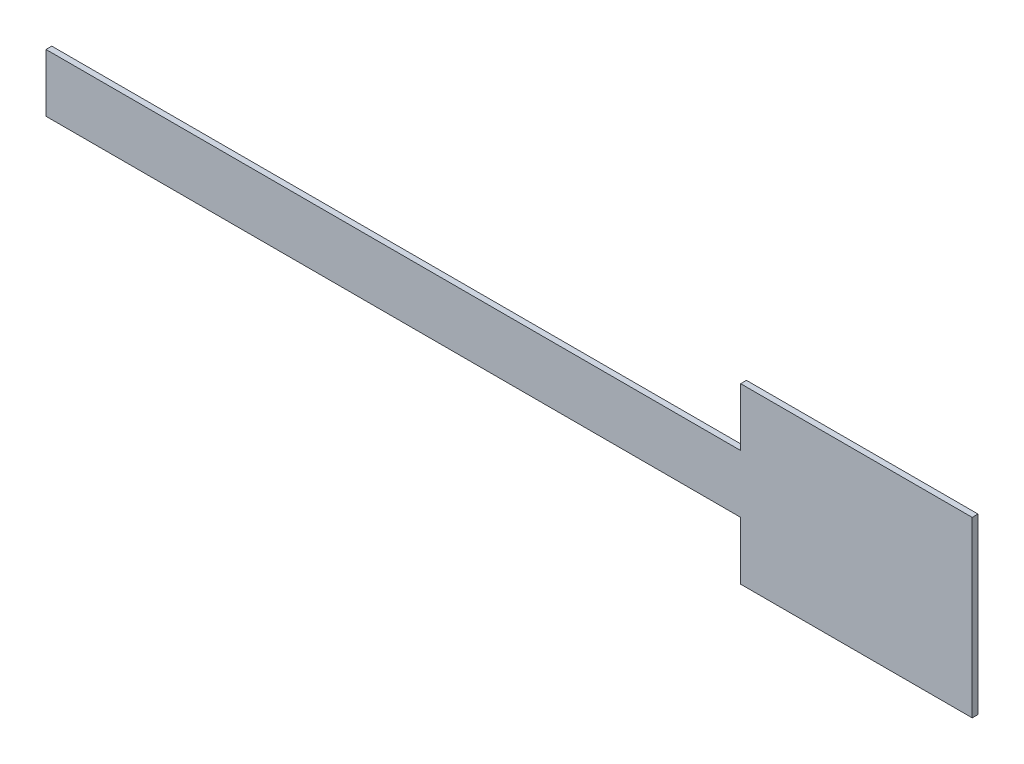
ISO-10303-21;
HEADER;
FILE_DESCRIPTION(('STEP AP214'),'2;1');
FILE_NAME('part.step','',(''),(''),'','','');
FILE_SCHEMA(('AUTOMOTIVE_DESIGN { 1 0 10303 214 1 1 1 1 }'));
ENDSEC;
DATA;
#1=APPLICATION_CONTEXT('core data for automotive mechanical design processes');
#2=APPLICATION_PROTOCOL_DEFINITION('international standard','automotive_design',2000,#1);
#3=PRODUCT_CONTEXT('',#1,'mechanical');
#4=PRODUCT('Part','Part','',(#3));
#5=PRODUCT_RELATED_PRODUCT_CATEGORY('part','',(#4));
#6=PRODUCT_DEFINITION_FORMATION('','',#4);
#7=PRODUCT_DEFINITION_CONTEXT('part definition',#1,'design');
#8=PRODUCT_DEFINITION('design','',#6,#7);
#9=PRODUCT_DEFINITION_SHAPE('','',#8);
#10=(LENGTH_UNIT() NAMED_UNIT(*) SI_UNIT(.MILLI.,.METRE.));
#11=(NAMED_UNIT(*) PLANE_ANGLE_UNIT() SI_UNIT($,.RADIAN.));
#12=(NAMED_UNIT(*) SI_UNIT($,.STERADIAN.) SOLID_ANGLE_UNIT());
#13=UNCERTAINTY_MEASURE_WITH_UNIT(LENGTH_MEASURE(1.E-05),#10,'distance_accuracy_value','');
#14=(GEOMETRIC_REPRESENTATION_CONTEXT(3) GLOBAL_UNCERTAINTY_ASSIGNED_CONTEXT((#13)) GLOBAL_UNIT_ASSIGNED_CONTEXT((#10,
#11,#12)) REPRESENTATION_CONTEXT('',''));
#15=CARTESIAN_POINT('',(0.,0.,0.));
#16=DIRECTION('',(0.,0.,1.));
#17=DIRECTION('',(1.,0.,0.));
#18=AXIS2_PLACEMENT_3D('',#15,#16,#17);
#19=CARTESIAN_POINT('',(-237.983861782121,0.686513851456686,2.54));
#20=DIRECTION('',(0.,1.,0.));
#21=DIRECTION('',(0.,0.,1.));
#22=AXIS2_PLACEMENT_3D('',#19,#20,#21);
#23=PLANE('',#22);
#24=DIRECTION('',(1.,0.,0.));
#25=VECTOR('',#24,1.);
#26=CARTESIAN_POINT('',(-237.983861782121,0.686513851456686,0.));
#27=LINE('',#26,#25);
#28=CARTESIAN_POINT('',(-237.983861782121,0.686513851456686,0.));
#29=VERTEX_POINT('',#28);
#30=CARTESIAN_POINT('',(66.8161382178786,0.686513851456686,0.));
#31=VERTEX_POINT('',#30);
#32=EDGE_CURVE('E129',#29,#31,#27,.T.);
#33=ORIENTED_EDGE('',*,*,#32,.T.);
#34=DIRECTION('',(0.,0.,-1.));
#35=VECTOR('',#34,1.);
#36=CARTESIAN_POINT('',(66.8161382178786,0.686513851456686,2.54));
#37=LINE('',#36,#35);
#38=CARTESIAN_POINT('',(66.8161382178786,0.686513851456686,2.54));
#39=VERTEX_POINT('',#38);
#40=EDGE_CURVE('E11',#39,#31,#37,.T.);
#41=ORIENTED_EDGE('',*,*,#40,.F.);
#42=DIRECTION('',(1.,0.,0.));
#43=VECTOR('',#42,1.);
#44=CARTESIAN_POINT('',(-237.983861782121,0.686513851456686,2.54));
#45=LINE('',#44,#43);
#46=CARTESIAN_POINT('',(-237.983861782121,0.686513851456686,2.54));
#47=VERTEX_POINT('',#46);
#48=EDGE_CURVE('E143',#47,#39,#45,.T.);
#49=ORIENTED_EDGE('',*,*,#48,.F.);
#50=DIRECTION('',(0.,0.,-1.));
#51=VECTOR('',#50,1.);
#52=CARTESIAN_POINT('',(-237.983861782121,0.686513851456686,2.54));
#53=LINE('',#52,#51);
#54=EDGE_CURVE('E125',#47,#29,#53,.T.);
#55=ORIENTED_EDGE('',*,*,#54,.T.);
#56=EDGE_LOOP('',(#33,#41,#49,#55));
#57=FACE_BOUND('',#56,.T.);
#58=ADVANCED_FACE('F33',(#57),#23,.F.);
#59=CARTESIAN_POINT('',(66.8161382178786,0.686513851456686,2.54));
#60=DIRECTION('',(1.,0.,0.));
#61=DIRECTION('',(0.,1.,0.));
#62=AXIS2_PLACEMENT_3D('',#59,#60,#61);
#63=PLANE('',#62);
#64=DIRECTION('',(0.,-1.,0.));
#65=VECTOR('',#64,1.);
#66=CARTESIAN_POINT('',(66.8161382178786,0.686513851456686,0.));
#67=LINE('',#66,#65);
#68=CARTESIAN_POINT('',(66.8161382178786,-24.7134861485433,0.));
#69=VERTEX_POINT('',#68);
#70=EDGE_CURVE('E132',#31,#69,#67,.T.);
#71=ORIENTED_EDGE('',*,*,#70,.T.);
#72=DIRECTION('',(0.,0.,-1.));
#73=VECTOR('',#72,1.);
#74=CARTESIAN_POINT('',(66.8161382178786,-24.7134861485433,2.54));
#75=LINE('',#74,#73);
#76=CARTESIAN_POINT('',(66.8161382178786,-24.7134861485433,2.54));
#77=VERTEX_POINT('',#76);
#78=EDGE_CURVE('E41',#77,#69,#75,.T.);
#79=ORIENTED_EDGE('',*,*,#78,.F.);
#80=DIRECTION('',(0.,-1.,0.));
#81=VECTOR('',#80,1.);
#82=CARTESIAN_POINT('',(66.8161382178786,0.686513851456686,2.54));
#83=LINE('',#82,#81);
#84=EDGE_CURVE('E92',#39,#77,#83,.T.);
#85=ORIENTED_EDGE('',*,*,#84,.F.);
#86=ORIENTED_EDGE('',*,*,#40,.T.);
#87=EDGE_LOOP('',(#71,#79,#85,#86));
#88=FACE_BOUND('',#87,.T.);
#89=ADVANCED_FACE('F178',(#88),#63,.F.);
#90=CARTESIAN_POINT('',(66.8161382178786,-24.7134861485433,2.54));
#91=DIRECTION('',(0.,1.,0.));
#92=DIRECTION('',(0.,0.,1.));
#93=AXIS2_PLACEMENT_3D('',#90,#91,#92);
#94=PLANE('',#93);
#95=DIRECTION('',(1.,0.,0.));
#96=VECTOR('',#95,1.);
#97=CARTESIAN_POINT('',(66.8161382178786,-24.7134861485433,0.));
#98=LINE('',#97,#96);
#99=CARTESIAN_POINT('',(168.416138217879,-24.7134861485433,0.));
#100=VERTEX_POINT('',#99);
#101=EDGE_CURVE('E134',#69,#100,#98,.T.);
#102=ORIENTED_EDGE('',*,*,#101,.T.);
#103=DIRECTION('',(0.,0.,-1.));
#104=VECTOR('',#103,1.);
#105=CARTESIAN_POINT('',(168.416138217879,-24.7134861485433,2.54));
#106=LINE('',#105,#104);
#107=CARTESIAN_POINT('',(168.416138217879,-24.7134861485433,2.54));
#108=VERTEX_POINT('',#107);
#109=EDGE_CURVE('E150',#108,#100,#106,.T.);
#110=ORIENTED_EDGE('',*,*,#109,.F.);
#111=DIRECTION('',(1.,0.,0.));
#112=VECTOR('',#111,1.);
#113=CARTESIAN_POINT('',(66.8161382178786,-24.7134861485433,2.54));
#114=LINE('',#113,#112);
#115=EDGE_CURVE('E158',#77,#108,#114,.T.);
#116=ORIENTED_EDGE('',*,*,#115,.F.);
#117=ORIENTED_EDGE('',*,*,#78,.T.);
#118=EDGE_LOOP('',(#102,#110,#116,#117));
#119=FACE_BOUND('',#118,.T.);
#120=ADVANCED_FACE('F156',(#119),#94,.F.);
#121=CARTESIAN_POINT('',(168.416138217879,51.4865138514567,2.54));
#122=DIRECTION('',(-1.,0.,0.));
#123=DIRECTION('',(0.,-1.,0.));
#124=AXIS2_PLACEMENT_3D('',#121,#122,#123);
#125=PLANE('',#124);
#126=DIRECTION('',(0.,1.,0.));
#127=VECTOR('',#126,1.);
#128=CARTESIAN_POINT('',(168.416138217879,51.4865138514567,0.));
#129=LINE('',#128,#127);
#130=CARTESIAN_POINT('',(168.416138217879,51.4865138514567,0.));
#131=VERTEX_POINT('',#130);
#132=EDGE_CURVE('E136',#100,#131,#129,.T.);
#133=ORIENTED_EDGE('',*,*,#132,.T.);
#134=DIRECTION('',(0.,0.,-1.));
#135=VECTOR('',#134,1.);
#136=CARTESIAN_POINT('',(168.416138217879,51.4865138514567,2.54));
#137=LINE('',#136,#135);
#138=CARTESIAN_POINT('',(168.416138217879,51.4865138514567,2.54));
#139=VERTEX_POINT('',#138);
#140=EDGE_CURVE('E147',#139,#131,#137,.T.);
#141=ORIENTED_EDGE('',*,*,#140,.F.);
#142=DIRECTION('',(0.,1.,0.));
#143=VECTOR('',#142,1.);
#144=CARTESIAN_POINT('',(168.416138217879,51.4865138514567,2.54));
#145=LINE('',#144,#143);
#146=EDGE_CURVE('E170',#108,#139,#145,.T.);
#147=ORIENTED_EDGE('',*,*,#146,.F.);
#148=ORIENTED_EDGE('',*,*,#109,.T.);
#149=EDGE_LOOP('',(#133,#141,#147,#148));
#150=FACE_BOUND('',#149,.T.);
#151=ADVANCED_FACE('F166',(#150),#125,.F.);
#152=CARTESIAN_POINT('',(66.8161382178786,51.4865138514567,2.54));
#153=DIRECTION('',(0.,-1.,0.));
#154=DIRECTION('',(0.,0.,-1.));
#155=AXIS2_PLACEMENT_3D('',#152,#153,#154);
#156=PLANE('',#155);
#157=DIRECTION('',(-1.,0.,0.));
#158=VECTOR('',#157,1.);
#159=CARTESIAN_POINT('',(66.8161382178786,51.4865138514567,0.));
#160=LINE('',#159,#158);
#161=CARTESIAN_POINT('',(66.8161382178786,51.4865138514567,0.));
#162=VERTEX_POINT('',#161);
#163=EDGE_CURVE('E138',#131,#162,#160,.T.);
#164=ORIENTED_EDGE('',*,*,#163,.T.);
#165=DIRECTION('',(0.,0.,-1.));
#166=VECTOR('',#165,1.);
#167=CARTESIAN_POINT('',(66.8161382178786,51.4865138514567,2.54));
#168=LINE('',#167,#166);
#169=CARTESIAN_POINT('',(66.8161382178786,51.4865138514567,2.54));
#170=VERTEX_POINT('',#169);
#171=EDGE_CURVE('E120',#170,#162,#168,.T.);
#172=ORIENTED_EDGE('',*,*,#171,.F.);
#173=DIRECTION('',(-1.,0.,0.));
#174=VECTOR('',#173,1.);
#175=CARTESIAN_POINT('',(66.8161382178786,51.4865138514567,2.54));
#176=LINE('',#175,#174);
#177=EDGE_CURVE('E111',#139,#170,#176,.T.);
#178=ORIENTED_EDGE('',*,*,#177,.F.);
#179=ORIENTED_EDGE('',*,*,#140,.T.);
#180=EDGE_LOOP('',(#164,#172,#178,#179));
#181=FACE_BOUND('',#180,.T.);
#182=ADVANCED_FACE('F169',(#181),#156,.F.);
#183=CARTESIAN_POINT('',(66.8161382178786,51.4865138514567,2.54));
#184=DIRECTION('',(1.,0.,0.));
#185=DIRECTION('',(0.,0.,-1.));
#186=AXIS2_PLACEMENT_3D('',#183,#184,#185);
#187=PLANE('',#186);
#188=DIRECTION('',(0.,-1.,0.));
#189=VECTOR('',#188,1.);
#190=CARTESIAN_POINT('',(66.8161382178786,51.4865138514567,0.));
#191=LINE('',#190,#189);
#192=CARTESIAN_POINT('',(66.8161382178786,26.0865138514567,0.));
#193=VERTEX_POINT('',#192);
#194=EDGE_CURVE('E119',#162,#193,#191,.T.);
#195=ORIENTED_EDGE('',*,*,#194,.T.);
#196=DIRECTION('',(0.,0.,-1.));
#197=VECTOR('',#196,1.);
#198=CARTESIAN_POINT('',(66.8161382178786,26.0865138514567,2.54));
#199=LINE('',#198,#197);
#200=CARTESIAN_POINT('',(66.8161382178786,26.0865138514567,2.54));
#201=VERTEX_POINT('',#200);
#202=EDGE_CURVE('E116',#201,#193,#199,.T.);
#203=ORIENTED_EDGE('',*,*,#202,.F.);
#204=DIRECTION('',(0.,-1.,0.));
#205=VECTOR('',#204,1.);
#206=CARTESIAN_POINT('',(66.8161382178786,51.4865138514567,2.54));
#207=LINE('',#206,#205);
#208=EDGE_CURVE('E105',#170,#201,#207,.T.);
#209=ORIENTED_EDGE('',*,*,#208,.F.);
#210=ORIENTED_EDGE('',*,*,#171,.T.);
#211=EDGE_LOOP('',(#195,#203,#209,#210));
#212=FACE_BOUND('',#211,.T.);
#213=ADVANCED_FACE('F117',(#212),#187,.F.);
#214=CARTESIAN_POINT('',(-237.983861782121,26.0865138514567,2.54));
#215=DIRECTION('',(0.,-1.,0.));
#216=DIRECTION('',(1.,0.,0.));
#217=AXIS2_PLACEMENT_3D('',#214,#215,#216);
#218=PLANE('',#217);
#219=DIRECTION('',(-1.,0.,0.));
#220=VECTOR('',#219,1.);
#221=CARTESIAN_POINT('',(-237.983861782121,26.0865138514567,0.));
#222=LINE('',#221,#220);
#223=CARTESIAN_POINT('',(-237.983861782121,26.0865138514567,0.));
#224=VERTEX_POINT('',#223);
#225=EDGE_CURVE('E78',#193,#224,#222,.T.);
#226=ORIENTED_EDGE('',*,*,#225,.T.);
#227=DIRECTION('',(0.,0.,-1.));
#228=VECTOR('',#227,1.);
#229=CARTESIAN_POINT('',(-237.983861782121,26.0865138514567,2.54));
#230=LINE('',#229,#228);
#231=CARTESIAN_POINT('',(-237.983861782121,26.0865138514567,2.54));
#232=VERTEX_POINT('',#231);
#233=EDGE_CURVE('E121',#232,#224,#230,.T.);
#234=ORIENTED_EDGE('',*,*,#233,.F.);
#235=DIRECTION('',(-1.,0.,0.));
#236=VECTOR('',#235,1.);
#237=CARTESIAN_POINT('',(-237.983861782121,26.0865138514567,2.54));
#238=LINE('',#237,#236);
#239=EDGE_CURVE('E109',#201,#232,#238,.T.);
#240=ORIENTED_EDGE('',*,*,#239,.F.);
#241=ORIENTED_EDGE('',*,*,#202,.T.);
#242=EDGE_LOOP('',(#226,#234,#240,#241));
#243=FACE_BOUND('',#242,.T.);
#244=ADVANCED_FACE('F123',(#243),#218,.F.);
#245=CARTESIAN_POINT('',(-237.983861782121,26.0865138514567,2.54));
#246=DIRECTION('',(1.,0.,0.));
#247=DIRECTION('',(0.,0.,-1.));
#248=AXIS2_PLACEMENT_3D('',#245,#246,#247);
#249=PLANE('',#248);
#250=DIRECTION('',(0.,-1.,0.));
#251=VECTOR('',#250,1.);
#252=CARTESIAN_POINT('',(-237.983861782121,26.0865138514567,0.));
#253=LINE('',#252,#251);
#254=EDGE_CURVE('E84',#224,#29,#253,.T.);
#255=ORIENTED_EDGE('',*,*,#254,.T.);
#256=ORIENTED_EDGE('',*,*,#54,.F.);
#257=DIRECTION('',(0.,-1.,0.));
#258=VECTOR('',#257,1.);
#259=CARTESIAN_POINT('',(-237.983861782121,26.0865138514567,2.54));
#260=LINE('',#259,#258);
#261=EDGE_CURVE('E49',#232,#47,#260,.T.);
#262=ORIENTED_EDGE('',*,*,#261,.F.);
#263=ORIENTED_EDGE('',*,*,#233,.T.);
#264=EDGE_LOOP('',(#255,#256,#262,#263));
#265=FACE_BOUND('',#264,.T.);
#266=ADVANCED_FACE('F194',(#265),#249,.F.);
#267=CARTESIAN_POINT('',(0.,0.,2.54));
#268=DIRECTION('',(0.,0.,-1.));
#269=DIRECTION('',(-1.,0.,0.));
#270=AXIS2_PLACEMENT_3D('',#267,#268,#269);
#271=PLANE('',#270);
#272=ORIENTED_EDGE('',*,*,#48,.T.);
#273=ORIENTED_EDGE('',*,*,#84,.T.);
#274=ORIENTED_EDGE('',*,*,#115,.T.);
#275=ORIENTED_EDGE('',*,*,#146,.T.);
#276=ORIENTED_EDGE('',*,*,#177,.T.);
#277=ORIENTED_EDGE('',*,*,#208,.T.);
#278=ORIENTED_EDGE('',*,*,#239,.T.);
#279=ORIENTED_EDGE('',*,*,#261,.T.);
#280=EDGE_LOOP('',(#272,#273,#274,#275,#276,#277,#278,#279));
#281=FACE_BOUND('',#280,.T.);
#282=ADVANCED_FACE('F107',(#281),#271,.F.);
#283=CARTESIAN_POINT('',(0.,0.,0.));
#284=DIRECTION('',(0.,0.,-1.));
#285=DIRECTION('',(-1.,0.,0.));
#286=AXIS2_PLACEMENT_3D('',#283,#284,#285);
#287=PLANE('',#286);
#288=ORIENTED_EDGE('',*,*,#32,.F.);
#289=ORIENTED_EDGE('',*,*,#254,.F.);
#290=ORIENTED_EDGE('',*,*,#225,.F.);
#291=ORIENTED_EDGE('',*,*,#194,.F.);
#292=ORIENTED_EDGE('',*,*,#163,.F.);
#293=ORIENTED_EDGE('',*,*,#132,.F.);
#294=ORIENTED_EDGE('',*,*,#101,.F.);
#295=ORIENTED_EDGE('',*,*,#70,.F.);
#296=EDGE_LOOP('',(#288,#289,#290,#291,#292,#293,#294,#295));
#297=FACE_BOUND('',#296,.T.);
#298=ADVANCED_FACE('F162',(#297),#287,.T.);
#299=CLOSED_SHELL('',(#58,#89,#120,#151,#182,#213,#244,#266,#282,#298));
#300=MANIFOLD_SOLID_BREP('B2',#299);
#301=ADVANCED_BREP_SHAPE_REPRESENTATION('',(#18,#300),#14);
#302=SHAPE_DEFINITION_REPRESENTATION(#9,#301);
ENDSEC;
END-ISO-10303-21;
